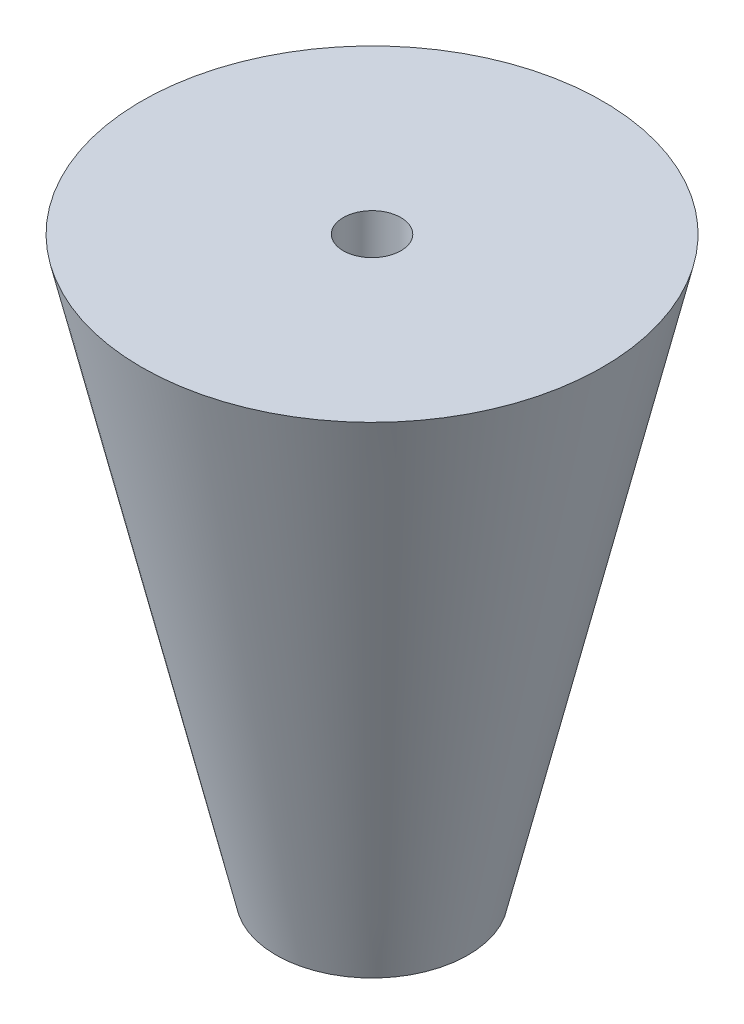
ISO-10303-21;
HEADER;
FILE_DESCRIPTION(('STEP AP214'),'2;1');
FILE_NAME('part.step','',(''),(''),'','','');
FILE_SCHEMA(('AUTOMOTIVE_DESIGN { 1 0 10303 214 1 1 1 1 }'));
ENDSEC;
DATA;
#1=APPLICATION_CONTEXT('core data for automotive mechanical design processes');
#2=APPLICATION_PROTOCOL_DEFINITION('international standard','automotive_design',2000,#1);
#3=PRODUCT_CONTEXT('',#1,'mechanical');
#4=PRODUCT('Part','Part','',(#3));
#5=PRODUCT_RELATED_PRODUCT_CATEGORY('part','',(#4));
#6=PRODUCT_DEFINITION_FORMATION('','',#4);
#7=PRODUCT_DEFINITION_CONTEXT('part definition',#1,'design');
#8=PRODUCT_DEFINITION('design','',#6,#7);
#9=PRODUCT_DEFINITION_SHAPE('','',#8);
#10=(LENGTH_UNIT() NAMED_UNIT(*) SI_UNIT(.MILLI.,.METRE.));
#11=(NAMED_UNIT(*) PLANE_ANGLE_UNIT() SI_UNIT($,.RADIAN.));
#12=(NAMED_UNIT(*) SI_UNIT($,.STERADIAN.) SOLID_ANGLE_UNIT());
#13=UNCERTAINTY_MEASURE_WITH_UNIT(LENGTH_MEASURE(1.E-05),#10,'distance_accuracy_value','');
#14=(GEOMETRIC_REPRESENTATION_CONTEXT(3) GLOBAL_UNCERTAINTY_ASSIGNED_CONTEXT((#13)) GLOBAL_UNIT_ASSIGNED_CONTEXT((#10,
#11,#12)) REPRESENTATION_CONTEXT('',''));
#15=CARTESIAN_POINT('',(0.,0.,0.));
#16=DIRECTION('',(0.,0.,1.));
#17=DIRECTION('',(1.,0.,0.));
#18=AXIS2_PLACEMENT_3D('',#15,#16,#17);
#19=CARTESIAN_POINT('',(0.,0.,0.));
#20=DIRECTION('',(0.,1.,0.));
#21=DIRECTION('',(0.,0.,1.));
#22=AXIS2_PLACEMENT_3D('',#19,#20,#21);
#23=PLANE('',#22);
#24=CARTESIAN_POINT('',(0.,0.,0.));
#25=DIRECTION('',(0.,1.,0.));
#26=DIRECTION('',(0.,0.,1.));
#27=AXIS2_PLACEMENT_3D('',#24,#25,#26);
#28=CIRCLE('',#27,5.);
#29=CARTESIAN_POINT('',(0.,0.,5.));
#30=VERTEX_POINT('',#29);
#31=EDGE_CURVE('E48',#30,#30,#28,.T.);
#32=ORIENTED_EDGE('',*,*,#31,.F.);
#33=EDGE_LOOP('',(#32));
#34=FACE_BOUND('',#33,.T.);
#35=ADVANCED_FACE('F41',(#34),#23,.F.);
#36=CARTESIAN_POINT('',(12.,30.,0.));
#37=DIRECTION('',(0.,-1.,0.));
#38=DIRECTION('',(0.,0.,-1.));
#39=AXIS2_PLACEMENT_3D('',#36,#37,#38);
#40=PLANE('',#39);
#41=CARTESIAN_POINT('',(0.,30.,0.));
#42=DIRECTION('',(0.,1.,0.));
#43=DIRECTION('',(0.,0.,1.));
#44=AXIS2_PLACEMENT_3D('',#41,#42,#43);
#45=CIRCLE('',#44,1.5);
#46=CARTESIAN_POINT('',(0.,30.,1.5));
#47=VERTEX_POINT('',#46);
#48=EDGE_CURVE('E58',#47,#47,#45,.T.);
#49=ORIENTED_EDGE('',*,*,#48,.F.);
#50=EDGE_LOOP('',(#49));
#51=FACE_BOUND('',#50,.T.);
#52=CARTESIAN_POINT('',(0.,30.,0.));
#53=DIRECTION('',(0.,1.,0.));
#54=DIRECTION('',(0.,0.,1.));
#55=AXIS2_PLACEMENT_3D('',#52,#53,#54);
#56=CIRCLE('',#55,12.);
#57=CARTESIAN_POINT('',(0.,30.,12.));
#58=VERTEX_POINT('',#57);
#59=EDGE_CURVE('E10',#58,#58,#56,.T.);
#60=ORIENTED_EDGE('',*,*,#59,.T.);
#61=EDGE_LOOP('',(#60));
#62=FACE_BOUND('',#61,.T.);
#63=ADVANCED_FACE('F67',(#51,#62),#40,.F.);
#64=CARTESIAN_POINT('',(0.,0.,0.));
#65=DIRECTION('',(0.,1.,0.));
#66=DIRECTION('',(0.,0.,1.));
#67=AXIS2_PLACEMENT_3D('',#64,#65,#66);
#68=CONICAL_SURFACE('',#67,5.,0.229231933276995);
#69=ORIENTED_EDGE('',*,*,#59,.F.);
#70=EDGE_LOOP('',(#69));
#71=FACE_BOUND('',#70,.T.);
#72=ORIENTED_EDGE('',*,*,#31,.T.);
#73=EDGE_LOOP('',(#72));
#74=FACE_BOUND('',#73,.T.);
#75=ADVANCED_FACE('F69',(#71,#74),#68,.T.);
#76=CARTESIAN_POINT('',(0.,20.,0.));
#77=DIRECTION('',(0.,1.,0.));
#78=DIRECTION('',(0.,0.,1.));
#79=AXIS2_PLACEMENT_3D('',#76,#77,#78);
#80=CYLINDRICAL_SURFACE('',#79,1.5);
#81=CARTESIAN_POINT('',(0.,20.,0.));
#82=DIRECTION('',(0.,1.,0.));
#83=DIRECTION('',(0.,0.,1.));
#84=AXIS2_PLACEMENT_3D('',#81,#82,#83);
#85=CIRCLE('',#84,1.5);
#86=CARTESIAN_POINT('',(0.,20.,1.5));
#87=VERTEX_POINT('',#86);
#88=EDGE_CURVE('E53',#87,#87,#85,.T.);
#89=ORIENTED_EDGE('',*,*,#88,.F.);
#90=EDGE_LOOP('',(#89));
#91=FACE_BOUND('',#90,.T.);
#92=ORIENTED_EDGE('',*,*,#48,.T.);
#93=EDGE_LOOP('',(#92));
#94=FACE_BOUND('',#93,.T.);
#95=ADVANCED_FACE('F65',(#91,#94),#80,.F.);
#96=CARTESIAN_POINT('',(0.,20.,0.));
#97=DIRECTION('',(0.,1.,0.));
#98=DIRECTION('',(0.,0.,1.));
#99=AXIS2_PLACEMENT_3D('',#96,#97,#98);
#100=PLANE('',#99);
#101=ORIENTED_EDGE('',*,*,#88,.T.);
#102=EDGE_LOOP('',(#101));
#103=FACE_BOUND('',#102,.T.);
#104=ADVANCED_FACE('F80',(#103),#100,.T.);
#105=CLOSED_SHELL('',(#35,#63,#75,#95,#104));
#106=MANIFOLD_SOLID_BREP('B2',#105);
#107=ADVANCED_BREP_SHAPE_REPRESENTATION('',(#18,#106),#14);
#108=SHAPE_DEFINITION_REPRESENTATION(#9,#107);
ENDSEC;
END-ISO-10303-21;
